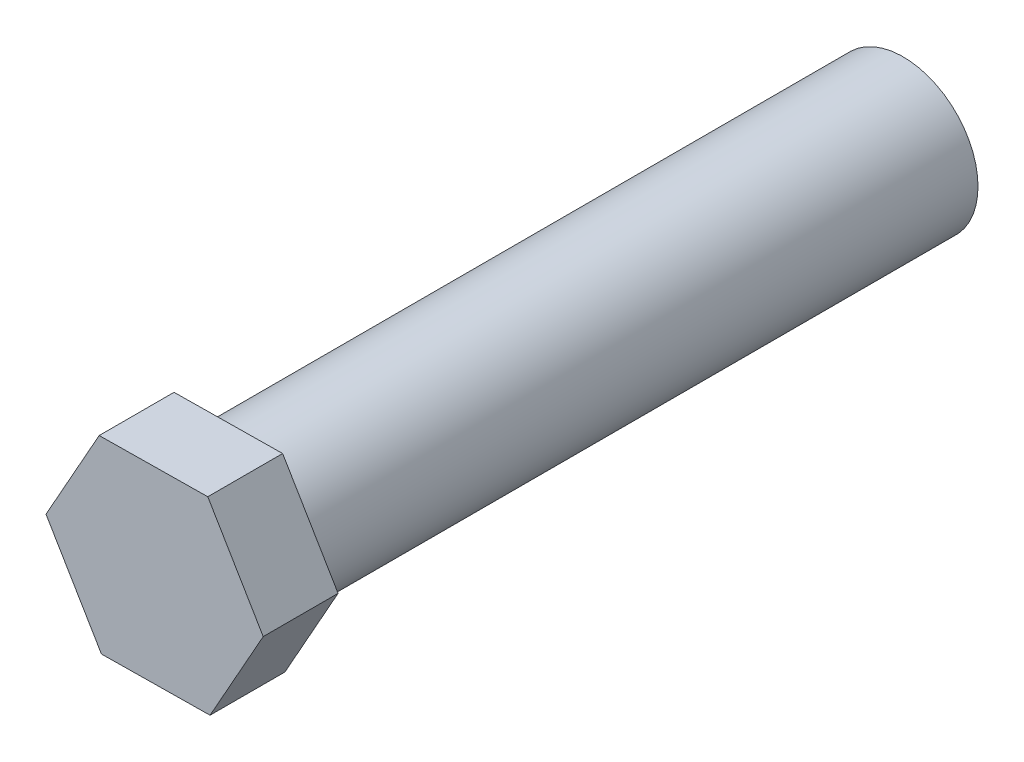
ISO-10303-21;
HEADER;
FILE_DESCRIPTION(('STEP AP214'),'2;1');
FILE_NAME('part.step','',(''),(''),'','','');
FILE_SCHEMA(('AUTOMOTIVE_DESIGN { 1 0 10303 214 1 1 1 1 }'));
ENDSEC;
DATA;
#1=APPLICATION_CONTEXT('core data for automotive mechanical design processes');
#2=APPLICATION_PROTOCOL_DEFINITION('international standard','automotive_design',2000,#1);
#3=PRODUCT_CONTEXT('',#1,'mechanical');
#4=PRODUCT('Part','Part','',(#3));
#5=PRODUCT_RELATED_PRODUCT_CATEGORY('part','',(#4));
#6=PRODUCT_DEFINITION_FORMATION('','',#4);
#7=PRODUCT_DEFINITION_CONTEXT('part definition',#1,'design');
#8=PRODUCT_DEFINITION('design','',#6,#7);
#9=PRODUCT_DEFINITION_SHAPE('','',#8);
#10=(LENGTH_UNIT() NAMED_UNIT(*) SI_UNIT(.MILLI.,.METRE.));
#11=(NAMED_UNIT(*) PLANE_ANGLE_UNIT() SI_UNIT($,.RADIAN.));
#12=(NAMED_UNIT(*) SI_UNIT($,.STERADIAN.) SOLID_ANGLE_UNIT());
#13=UNCERTAINTY_MEASURE_WITH_UNIT(LENGTH_MEASURE(1.E-05),#10,'distance_accuracy_value','');
#14=(GEOMETRIC_REPRESENTATION_CONTEXT(3) GLOBAL_UNCERTAINTY_ASSIGNED_CONTEXT((#13)) GLOBAL_UNIT_ASSIGNED_CONTEXT((#10,
#11,#12)) REPRESENTATION_CONTEXT('',''));
#15=CARTESIAN_POINT('',(0.,0.,0.));
#16=DIRECTION('',(0.,0.,1.));
#17=DIRECTION('',(1.,0.,0.));
#18=AXIS2_PLACEMENT_3D('',#15,#16,#17);
#19=CARTESIAN_POINT('',(0.,0.,18.));
#20=DIRECTION('',(0.,0.,-1.));
#21=DIRECTION('',(-1.,0.,0.));
#22=AXIS2_PLACEMENT_3D('',#19,#20,#21);
#23=CYLINDRICAL_SURFACE('',#22,2.);
#24=CARTESIAN_POINT('',(0.,0.,18.));
#25=DIRECTION('',(0.,0.,1.));
#26=DIRECTION('',(1.,0.,0.));
#27=AXIS2_PLACEMENT_3D('',#24,#25,#26);
#28=CIRCLE('',#27,2.);
#29=CARTESIAN_POINT('',(2.,0.,18.));
#30=VERTEX_POINT('',#29);
#31=EDGE_CURVE('E11',#30,#30,#28,.T.);
#32=ORIENTED_EDGE('',*,*,#31,.F.);
#33=EDGE_LOOP('',(#32));
#34=FACE_BOUND('',#33,.T.);
#35=CARTESIAN_POINT('',(0.,0.,0.));
#36=DIRECTION('',(0.,0.,1.));
#37=DIRECTION('',(1.,0.,0.));
#38=AXIS2_PLACEMENT_3D('',#35,#36,#37);
#39=CIRCLE('',#38,2.);
#40=CARTESIAN_POINT('',(2.,0.,0.));
#41=VERTEX_POINT('',#40);
#42=EDGE_CURVE('E42',#41,#41,#39,.T.);
#43=ORIENTED_EDGE('',*,*,#42,.T.);
#44=EDGE_LOOP('',(#43));
#45=FACE_BOUND('',#44,.T.);
#46=ADVANCED_FACE('F39',(#34,#45),#23,.T.);
#47=CARTESIAN_POINT('',(0.,0.,0.));
#48=DIRECTION('',(0.,0.,1.));
#49=DIRECTION('',(1.,0.,0.));
#50=AXIS2_PLACEMENT_3D('',#47,#48,#49);
#51=PLANE('',#50);
#52=ORIENTED_EDGE('',*,*,#42,.F.);
#53=EDGE_LOOP('',(#52));
#54=FACE_BOUND('',#53,.T.);
#55=ADVANCED_FACE('F164',(#54),#51,.F.);
#56=CARTESIAN_POINT('',(-1.42078844908439,-2.5305602566412,20.));
#57=DIRECTION('',(-0.0120053904880414,0.999927932702767,0.));
#58=DIRECTION('',(-0.999927932702767,-0.0120053904880414,0.));
#59=AXIS2_PLACEMENT_3D('',#56,#57,#58);
#60=PLANE('',#59);
#61=DIRECTION('',(0.999927932702767,0.0120053904880414,0.));
#62=VECTOR('',#61,1.);
#63=CARTESIAN_POINT('',(-1.42078844908439,-2.5305602566412,18.));
#64=LINE('',#63,#62);
#65=CARTESIAN_POINT('',(-1.42078844908439,-2.5305602566412,18.));
#66=VERTEX_POINT('',#65);
#67=CARTESIAN_POINT('',(1.48113524351635,-2.49571901863117,18.));
#68=VERTEX_POINT('',#67);
#69=EDGE_CURVE('E129',#66,#68,#64,.T.);
#70=ORIENTED_EDGE('',*,*,#69,.T.);
#71=DIRECTION('',(0.,0.,-1.));
#72=VECTOR('',#71,1.);
#73=CARTESIAN_POINT('',(1.48113524351635,-2.49571901863117,20.));
#74=LINE('',#73,#72);
#75=CARTESIAN_POINT('',(1.48113524351635,-2.49571901863117,20.));
#76=VERTEX_POINT('',#75);
#77=EDGE_CURVE('E156',#76,#68,#74,.T.);
#78=ORIENTED_EDGE('',*,*,#77,.F.);
#79=DIRECTION('',(0.999927932702767,0.0120053904880414,0.));
#80=VECTOR('',#79,1.);
#81=CARTESIAN_POINT('',(-1.42078844908439,-2.5305602566412,20.));
#82=LINE('',#81,#80);
#83=CARTESIAN_POINT('',(-1.42078844908439,-2.5305602566412,20.));
#84=VERTEX_POINT('',#83);
#85=EDGE_CURVE('E145',#84,#76,#82,.T.);
#86=ORIENTED_EDGE('',*,*,#85,.F.);
#87=DIRECTION('',(0.,0.,-1.));
#88=VECTOR('',#87,1.);
#89=CARTESIAN_POINT('',(-1.42078844908439,-2.5305602566412,20.));
#90=LINE('',#89,#88);
#91=EDGE_CURVE('E125',#84,#66,#90,.T.);
#92=ORIENTED_EDGE('',*,*,#91,.T.);
#93=EDGE_LOOP('',(#70,#78,#86,#92));
#94=FACE_BOUND('',#93,.T.);
#95=ADVANCED_FACE('F166',(#94),#60,.F.);
#96=CARTESIAN_POINT('',(1.48113524351635,-2.49571901863117,20.));
#97=DIRECTION('',(-0.871965686918274,0.489566993206388,0.));
#98=DIRECTION('',(-0.489566993206388,-0.871965686918274,0.));
#99=AXIS2_PLACEMENT_3D('',#96,#97,#98);
#100=PLANE('',#99);
#101=DIRECTION('',(0.489566993206388,0.871965686918274,0.));
#102=VECTOR('',#101,1.);
#103=CARTESIAN_POINT('',(1.48113524351635,-2.49571901863117,18.));
#104=LINE('',#103,#102);
#105=CARTESIAN_POINT('',(2.90192369260074,0.0348412380100267,18.));
#106=VERTEX_POINT('',#105);
#107=EDGE_CURVE('E133',#68,#106,#104,.T.);
#108=ORIENTED_EDGE('',*,*,#107,.T.);
#109=DIRECTION('',(0.,0.,-1.));
#110=VECTOR('',#109,1.);
#111=CARTESIAN_POINT('',(2.90192369260074,0.0348412380100267,20.));
#112=LINE('',#111,#110);
#113=CARTESIAN_POINT('',(2.90192369260074,0.0348412380100267,20.));
#114=VERTEX_POINT('',#113);
#115=EDGE_CURVE('E152',#114,#106,#112,.T.);
#116=ORIENTED_EDGE('',*,*,#115,.F.);
#117=DIRECTION('',(0.489566993206388,0.871965686918274,0.));
#118=VECTOR('',#117,1.);
#119=CARTESIAN_POINT('',(1.48113524351635,-2.49571901863117,20.));
#120=LINE('',#119,#118);
#121=EDGE_CURVE('E94',#76,#114,#120,.T.);
#122=ORIENTED_EDGE('',*,*,#121,.F.);
#123=ORIENTED_EDGE('',*,*,#77,.T.);
#124=EDGE_LOOP('',(#108,#116,#122,#123));
#125=FACE_BOUND('',#124,.T.);
#126=ADVANCED_FACE('F171',(#125),#100,.F.);
#127=CARTESIAN_POINT('',(2.90192369260074,0.0348412380100267,20.));
#128=DIRECTION('',(-0.859960296430232,-0.510360939496379,0.));
#129=DIRECTION('',(0.510360939496379,-0.859960296430233,0.));
#130=AXIS2_PLACEMENT_3D('',#127,#128,#129);
#131=PLANE('',#130);
#132=DIRECTION('',(-0.510360939496379,0.859960296430232,0.));
#133=VECTOR('',#132,1.);
#134=CARTESIAN_POINT('',(2.90192369260074,0.0348412380100267,18.));
#135=LINE('',#134,#133);
#136=CARTESIAN_POINT('',(1.42078844908439,2.5305602566412,18.));
#137=VERTEX_POINT('',#136);
#138=EDGE_CURVE('E136',#106,#137,#135,.T.);
#139=ORIENTED_EDGE('',*,*,#138,.T.);
#140=DIRECTION('',(0.,0.,-1.));
#141=VECTOR('',#140,1.);
#142=CARTESIAN_POINT('',(1.42078844908439,2.5305602566412,20.));
#143=LINE('',#142,#141);
#144=CARTESIAN_POINT('',(1.42078844908439,2.5305602566412,20.));
#145=VERTEX_POINT('',#144);
#146=EDGE_CURVE('E118',#145,#137,#143,.T.);
#147=ORIENTED_EDGE('',*,*,#146,.F.);
#148=DIRECTION('',(-0.510360939496379,0.859960296430232,0.));
#149=VECTOR('',#148,1.);
#150=CARTESIAN_POINT('',(2.90192369260074,0.0348412380100267,20.));
#151=LINE('',#150,#149);
#152=EDGE_CURVE('E107',#114,#145,#151,.T.);
#153=ORIENTED_EDGE('',*,*,#152,.F.);
#154=ORIENTED_EDGE('',*,*,#115,.T.);
#155=EDGE_LOOP('',(#139,#147,#153,#154));
#156=FACE_BOUND('',#155,.T.);
#157=ADVANCED_FACE('F178',(#156),#131,.F.);
#158=CARTESIAN_POINT('',(1.42078844908439,2.5305602566412,20.));
#159=DIRECTION('',(0.0120053904880412,-0.999927932702767,0.));
#160=DIRECTION('',(0.999927932702767,0.0120053904880412,0.));
#161=AXIS2_PLACEMENT_3D('',#158,#159,#160);
#162=PLANE('',#161);
#163=DIRECTION('',(-0.999927932702767,-0.0120053904880412,0.));
#164=VECTOR('',#163,1.);
#165=CARTESIAN_POINT('',(1.42078844908439,2.5305602566412,18.));
#166=LINE('',#165,#164);
#167=CARTESIAN_POINT('',(-1.48113524351635,2.49571901863117,18.));
#168=VERTEX_POINT('',#167);
#169=EDGE_CURVE('E116',#137,#168,#166,.T.);
#170=ORIENTED_EDGE('',*,*,#169,.T.);
#171=DIRECTION('',(0.,0.,-1.));
#172=VECTOR('',#171,1.);
#173=CARTESIAN_POINT('',(-1.48113524351635,2.49571901863117,20.));
#174=LINE('',#173,#172);
#175=CARTESIAN_POINT('',(-1.48113524351635,2.49571901863117,20.));
#176=VERTEX_POINT('',#175);
#177=EDGE_CURVE('E113',#176,#168,#174,.T.);
#178=ORIENTED_EDGE('',*,*,#177,.F.);
#179=DIRECTION('',(-0.999927932702767,-0.0120053904880412,0.));
#180=VECTOR('',#179,1.);
#181=CARTESIAN_POINT('',(1.42078844908439,2.5305602566412,20.));
#182=LINE('',#181,#180);
#183=EDGE_CURVE('E101',#145,#176,#182,.T.);
#184=ORIENTED_EDGE('',*,*,#183,.F.);
#185=ORIENTED_EDGE('',*,*,#146,.T.);
#186=EDGE_LOOP('',(#170,#178,#184,#185));
#187=FACE_BOUND('',#186,.T.);
#188=ADVANCED_FACE('F114',(#187),#162,.F.);
#189=CARTESIAN_POINT('',(-1.48113524351635,2.49571901863117,20.));
#190=DIRECTION('',(0.871965686918273,-0.489566993206388,0.));
#191=DIRECTION('',(0.489566993206388,0.871965686918274,0.));
#192=AXIS2_PLACEMENT_3D('',#189,#190,#191);
#193=PLANE('',#192);
#194=DIRECTION('',(-0.489566993206388,-0.871965686918274,0.));
#195=VECTOR('',#194,1.);
#196=CARTESIAN_POINT('',(-1.48113524351635,2.49571901863117,18.));
#197=LINE('',#196,#195);
#198=CARTESIAN_POINT('',(-2.90192369260074,-0.0348412380100262,18.));
#199=VERTEX_POINT('',#198);
#200=EDGE_CURVE('E79',#168,#199,#197,.T.);
#201=ORIENTED_EDGE('',*,*,#200,.T.);
#202=DIRECTION('',(0.,0.,-1.));
#203=VECTOR('',#202,1.);
#204=CARTESIAN_POINT('',(-2.90192369260074,-0.0348412380100262,20.));
#205=LINE('',#204,#203);
#206=CARTESIAN_POINT('',(-2.90192369260074,-0.0348412380100262,20.));
#207=VERTEX_POINT('',#206);
#208=EDGE_CURVE('E119',#207,#199,#205,.T.);
#209=ORIENTED_EDGE('',*,*,#208,.F.);
#210=DIRECTION('',(-0.489566993206388,-0.871965686918274,0.));
#211=VECTOR('',#210,1.);
#212=CARTESIAN_POINT('',(-1.48113524351635,2.49571901863117,20.));
#213=LINE('',#212,#211);
#214=EDGE_CURVE('E105',#176,#207,#213,.T.);
#215=ORIENTED_EDGE('',*,*,#214,.F.);
#216=ORIENTED_EDGE('',*,*,#177,.T.);
#217=EDGE_LOOP('',(#201,#209,#215,#216));
#218=FACE_BOUND('',#217,.T.);
#219=ADVANCED_FACE('F121',(#218),#193,.F.);
#220=CARTESIAN_POINT('',(-2.90192369260074,-0.0348412380100262,20.));
#221=DIRECTION('',(0.859960296430232,0.510360939496379,0.));
#222=DIRECTION('',(-0.510360939496379,0.859960296430232,0.));
#223=AXIS2_PLACEMENT_3D('',#220,#221,#222);
#224=PLANE('',#223);
#225=DIRECTION('',(0.510360939496379,-0.859960296430232,0.));
#226=VECTOR('',#225,1.);
#227=CARTESIAN_POINT('',(-2.90192369260074,-0.0348412380100262,18.));
#228=LINE('',#227,#226);
#229=EDGE_CURVE('E85',#199,#66,#228,.T.);
#230=ORIENTED_EDGE('',*,*,#229,.T.);
#231=ORIENTED_EDGE('',*,*,#91,.F.);
#232=DIRECTION('',(0.510360939496379,-0.859960296430232,0.));
#233=VECTOR('',#232,1.);
#234=CARTESIAN_POINT('',(-2.90192369260074,-0.0348412380100262,20.));
#235=LINE('',#234,#233);
#236=EDGE_CURVE('E56',#207,#84,#235,.T.);
#237=ORIENTED_EDGE('',*,*,#236,.F.);
#238=ORIENTED_EDGE('',*,*,#208,.T.);
#239=EDGE_LOOP('',(#230,#231,#237,#238));
#240=FACE_BOUND('',#239,.T.);
#241=ADVANCED_FACE('F186',(#240),#224,.F.);
#242=CARTESIAN_POINT('',(0.,0.,20.));
#243=DIRECTION('',(0.,0.,1.));
#244=DIRECTION('',(1.,0.,0.));
#245=AXIS2_PLACEMENT_3D('',#242,#243,#244);
#246=PLANE('',#245);
#247=ORIENTED_EDGE('',*,*,#85,.T.);
#248=ORIENTED_EDGE('',*,*,#121,.T.);
#249=ORIENTED_EDGE('',*,*,#152,.T.);
#250=ORIENTED_EDGE('',*,*,#183,.T.);
#251=ORIENTED_EDGE('',*,*,#214,.T.);
#252=ORIENTED_EDGE('',*,*,#236,.T.);
#253=EDGE_LOOP('',(#247,#248,#249,#250,#251,#252));
#254=FACE_BOUND('',#253,.T.);
#255=ADVANCED_FACE('F103',(#254),#246,.T.);
#256=CARTESIAN_POINT('',(0.,0.,18.));
#257=DIRECTION('',(0.,0.,1.));
#258=DIRECTION('',(1.,0.,0.));
#259=AXIS2_PLACEMENT_3D('',#256,#257,#258);
#260=PLANE('',#259);
#261=ORIENTED_EDGE('',*,*,#31,.T.);
#262=EDGE_LOOP('',(#261));
#263=FACE_BOUND('',#262,.T.);
#264=ORIENTED_EDGE('',*,*,#69,.F.);
#265=ORIENTED_EDGE('',*,*,#229,.F.);
#266=ORIENTED_EDGE('',*,*,#200,.F.);
#267=ORIENTED_EDGE('',*,*,#169,.F.);
#268=ORIENTED_EDGE('',*,*,#138,.F.);
#269=ORIENTED_EDGE('',*,*,#107,.F.);
#270=EDGE_LOOP('',(#264,#265,#266,#267,#268,#269));
#271=FACE_BOUND('',#270,.T.);
#272=ADVANCED_FACE('F189',(#263,#271),#260,.F.);
#273=CLOSED_SHELL('',(#46,#55,#95,#126,#157,#188,#219,#241,#255,#272));
#274=MANIFOLD_SOLID_BREP('B2',#273);
#275=ADVANCED_BREP_SHAPE_REPRESENTATION('',(#18,#274),#14);
#276=SHAPE_DEFINITION_REPRESENTATION(#9,#275);
ENDSEC;
END-ISO-10303-21;
